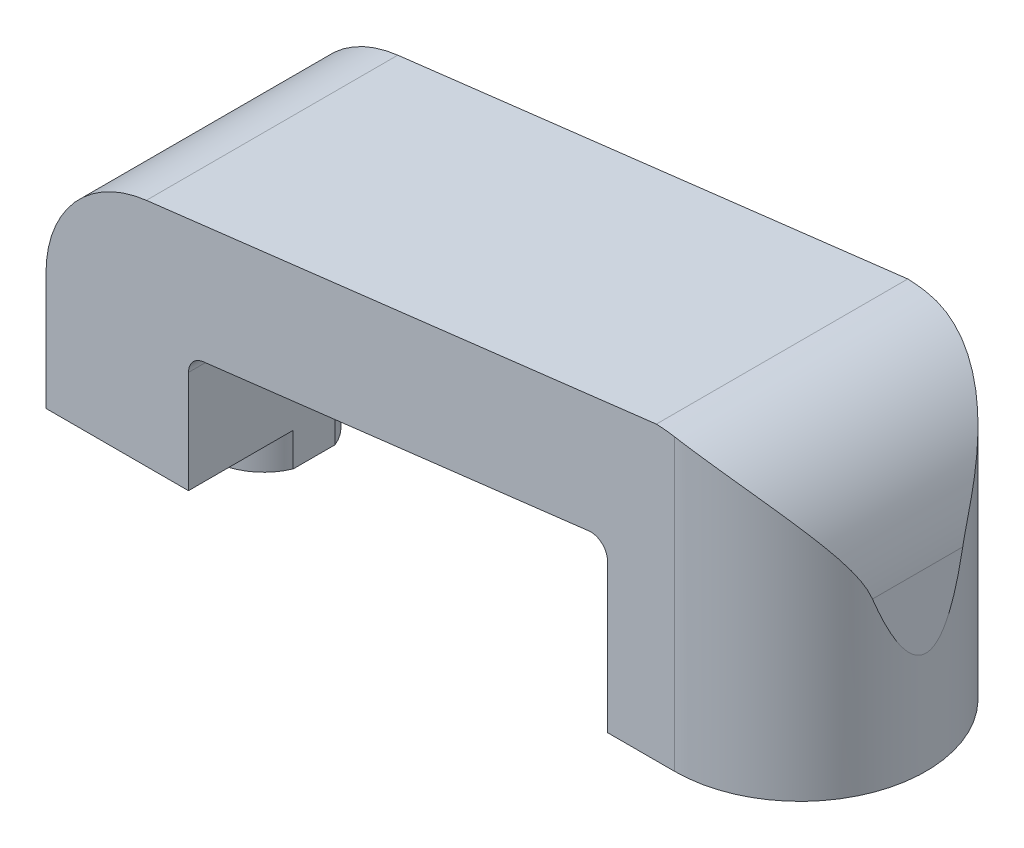
ISO-10303-21;
HEADER;
FILE_DESCRIPTION(('STEP AP214'),'2;1');
FILE_NAME('part.step','',(''),(''),'','','');
FILE_SCHEMA(('AUTOMOTIVE_DESIGN { 1 0 10303 214 1 1 1 1 }'));
ENDSEC;
DATA;
#1=APPLICATION_CONTEXT('core data for automotive mechanical design processes');
#2=APPLICATION_PROTOCOL_DEFINITION('international standard','automotive_design',2000,#1);
#3=PRODUCT_CONTEXT('',#1,'mechanical');
#4=PRODUCT('Part','Part','',(#3));
#5=PRODUCT_RELATED_PRODUCT_CATEGORY('part','',(#4));
#6=PRODUCT_DEFINITION_FORMATION('','',#4);
#7=PRODUCT_DEFINITION_CONTEXT('part definition',#1,'design');
#8=PRODUCT_DEFINITION('design','',#6,#7);
#9=PRODUCT_DEFINITION_SHAPE('','',#8);
#10=(LENGTH_UNIT() NAMED_UNIT(*) SI_UNIT(.MILLI.,.METRE.));
#11=(NAMED_UNIT(*) PLANE_ANGLE_UNIT() SI_UNIT($,.RADIAN.));
#12=(NAMED_UNIT(*) SI_UNIT($,.STERADIAN.) SOLID_ANGLE_UNIT());
#13=UNCERTAINTY_MEASURE_WITH_UNIT(LENGTH_MEASURE(1.E-05),#10,'distance_accuracy_value','');
#14=(GEOMETRIC_REPRESENTATION_CONTEXT(3) GLOBAL_UNCERTAINTY_ASSIGNED_CONTEXT((#13)) GLOBAL_UNIT_ASSIGNED_CONTEXT((#10,
#11,#12)) REPRESENTATION_CONTEXT('',''));
#15=CARTESIAN_POINT('',(0.,0.,0.));
#16=DIRECTION('',(0.,0.,1.));
#17=DIRECTION('',(1.,0.,0.));
#18=AXIS2_PLACEMENT_3D('',#15,#16,#17);
#19=CARTESIAN_POINT('',(0.,0.,15.));
#20=DIRECTION('',(0.,1.,0.));
#21=DIRECTION('',(0.,0.,1.));
#22=AXIS2_PLACEMENT_3D('',#19,#20,#21);
#23=PLANE('',#22);
#24=CARTESIAN_POINT('',(29.,0.,7.5));
#25=DIRECTION('',(0.,1.,0.));
#26=DIRECTION('',(0.,0.,1.));
#27=AXIS2_PLACEMENT_3D('',#24,#25,#26);
#28=CIRCLE('',#27,3.25);
#29=CARTESIAN_POINT('',(29.,0.,10.75));
#30=VERTEX_POINT('',#29);
#31=EDGE_CURVE('E12',#30,#30,#28,.F.);
#32=ORIENTED_EDGE('',*,*,#31,.F.);
#33=EDGE_LOOP('',(#32));
#34=FACE_BOUND('',#33,.T.);
#35=DIRECTION('',(1.,0.,0.));
#36=VECTOR('',#35,1.);
#37=CARTESIAN_POINT('',(0.,0.,0.));
#38=LINE('',#37,#36);
#39=CARTESIAN_POINT('',(25.,0.,0.));
#40=VERTEX_POINT('',#39);
#41=CARTESIAN_POINT('',(29.,0.,0.));
#42=VERTEX_POINT('',#41);
#43=EDGE_CURVE('E298',#40,#42,#38,.T.);
#44=ORIENTED_EDGE('',*,*,#43,.T.);
#45=CARTESIAN_POINT('',(29.,0.,7.5));
#46=DIRECTION('',(0.,-1.,0.));
#47=DIRECTION('',(0.,0.,-1.));
#48=AXIS2_PLACEMENT_3D('',#45,#46,#47);
#49=CIRCLE('',#48,7.5);
#50=CARTESIAN_POINT('',(29.,0.,15.));
#51=VERTEX_POINT('',#50);
#52=EDGE_CURVE('E191',#51,#42,#49,.F.);
#53=ORIENTED_EDGE('',*,*,#52,.F.);
#54=DIRECTION('',(1.,0.,0.));
#55=VECTOR('',#54,1.);
#56=CARTESIAN_POINT('',(0.,0.,15.));
#57=LINE('',#56,#55);
#58=CARTESIAN_POINT('',(25.,0.,15.));
#59=VERTEX_POINT('',#58);
#60=EDGE_CURVE('E305',#59,#51,#57,.T.);
#61=ORIENTED_EDGE('',*,*,#60,.F.);
#62=DIRECTION('',(0.,0.,-1.));
#63=VECTOR('',#62,1.);
#64=CARTESIAN_POINT('',(25.,0.,15.));
#65=LINE('',#64,#63);
#66=EDGE_CURVE('E302',#59,#40,#65,.T.);
#67=ORIENTED_EDGE('',*,*,#66,.T.);
#68=EDGE_LOOP('',(#44,#53,#61,#67));
#69=FACE_BOUND('',#68,.T.);
#70=ADVANCED_FACE('F58',(#34,#69),#23,.F.);
#71=CARTESIAN_POINT('',(0.,0.,15.));
#72=DIRECTION('',(0.,0.,1.));
#73=DIRECTION('',(1.,0.,0.));
#74=AXIS2_PLACEMENT_3D('',#71,#72,#73);
#75=PLANE('',#74);
#76=ORIENTED_EDGE('',*,*,#60,.T.);
#77=DIRECTION('',(0.,-1.,0.));
#78=VECTOR('',#77,1.);
#79=CARTESIAN_POINT('',(29.,25.,15.));
#80=LINE('',#79,#78);
#81=CARTESIAN_POINT('',(29.,17.28691057379,15.));
#82=VERTEX_POINT('',#81);
#83=EDGE_CURVE('E67',#51,#82,#80,.F.);
#84=ORIENTED_EDGE('',*,*,#83,.T.);
#85=CARTESIAN_POINT('',(27.579913930315,8.91708982116896,15.));
#86=DIRECTION('',(0.,0.,1.));
#87=DIRECTION('',(1.,0.,0.));
#88=AXIS2_PLACEMENT_3D('',#85,#86,#87);
#89=CIRCLE('',#88,8.48943719432087);
#90=CARTESIAN_POINT('',(27.9143195970498,17.3999382063739,15.));
#91=VERTEX_POINT('',#90);
#92=EDGE_CURVE('E301',#91,#82,#89,.F.);
#93=ORIENTED_EDGE('',*,*,#92,.F.);
#94=DIRECTION('',(0.992876838486922,0.119145220618431,0.));
#95=VECTOR('',#94,1.);
#96=CARTESIAN_POINT('',(-1.66209225410819,13.850768784235,15.));
#97=LINE('',#96,#95);
#98=CARTESIAN_POINT('',(-2.51273437525666,13.7486917296971,15.));
#99=VERTEX_POINT('',#98);
#100=EDGE_CURVE('E334',#99,#91,#97,.T.);
#101=ORIENTED_EDGE('',*,*,#100,.F.);
#102=CARTESIAN_POINT('',(-1.702891367693,7.,15.));
#103=DIRECTION('',(0.,0.,1.));
#104=DIRECTION('',(1.,0.,0.));
#105=AXIS2_PLACEMENT_3D('',#102,#103,#104);
#106=CIRCLE('',#105,6.797108632307);
#107=CARTESIAN_POINT('',(-8.5,7.,15.));
#108=VERTEX_POINT('',#107);
#109=EDGE_CURVE('E335',#99,#108,#106,.T.);
#110=ORIENTED_EDGE('',*,*,#109,.T.);
#111=DIRECTION('',(0.,1.,0.));
#112=VECTOR('',#111,1.);
#113=CARTESIAN_POINT('',(-8.5,0.,15.));
#114=LINE('',#113,#112);
#115=CARTESIAN_POINT('',(-8.5,0.,15.));
#116=VERTEX_POINT('',#115);
#117=EDGE_CURVE('E339',#116,#108,#114,.T.);
#118=ORIENTED_EDGE('',*,*,#117,.F.);
#119=DIRECTION('',(-1.,0.,0.));
#120=VECTOR('',#119,1.);
#121=CARTESIAN_POINT('',(0.,0.,15.));
#122=LINE('',#121,#120);
#123=CARTESIAN_POINT('',(0.,0.,15.));
#124=VERTEX_POINT('',#123);
#125=EDGE_CURVE('E342',#124,#116,#122,.T.);
#126=ORIENTED_EDGE('',*,*,#125,.F.);
#127=DIRECTION('',(0.,1.,0.));
#128=VECTOR('',#127,1.);
#129=CARTESIAN_POINT('',(0.,0.,15.));
#130=LINE('',#129,#128);
#131=CARTESIAN_POINT('',(0.,6.11282573503887,15.));
#132=VERTEX_POINT('',#131);
#133=EDGE_CURVE('E345',#124,#132,#130,.T.);
#134=ORIENTED_EDGE('',*,*,#133,.T.);
#135=CARTESIAN_POINT('',(1.,6.11282573503887,15.));
#136=DIRECTION('',(0.,0.,1.));
#137=DIRECTION('',(1.,0.,0.));
#138=AXIS2_PLACEMENT_3D('',#135,#136,#137);
#139=CIRCLE('',#138,0.999999999999999);
#140=CARTESIAN_POINT('',(0.88085477938157,7.10570257352579,15.));
#141=VERTEX_POINT('',#140);
#142=EDGE_CURVE('E347',#141,#132,#139,.T.);
#143=ORIENTED_EDGE('',*,*,#142,.F.);
#144=DIRECTION('',(0.992876838486922,0.119145220618431,0.));
#145=VECTOR('',#144,1.);
#146=CARTESIAN_POINT('',(-0.82807570977918,6.9006309148265,15.));
#147=LINE('',#146,#145);
#148=CARTESIAN_POINT('',(23.8808547793816,9.86570257352579,15.));
#149=VERTEX_POINT('',#148);
#150=EDGE_CURVE('E350',#141,#149,#147,.T.);
#151=ORIENTED_EDGE('',*,*,#150,.T.);
#152=CARTESIAN_POINT('',(24.,8.87282573503887,15.));
#153=DIRECTION('',(0.,0.,1.));
#154=DIRECTION('',(1.,0.,0.));
#155=AXIS2_PLACEMENT_3D('',#152,#153,#154);
#156=CIRCLE('',#155,1.);
#157=CARTESIAN_POINT('',(25.,8.87282573503887,15.));
#158=VERTEX_POINT('',#157);
#159=EDGE_CURVE('E352',#149,#158,#156,.F.);
#160=ORIENTED_EDGE('',*,*,#159,.T.);
#161=DIRECTION('',(0.,1.,0.));
#162=VECTOR('',#161,1.);
#163=CARTESIAN_POINT('',(25.,0.,15.));
#164=LINE('',#163,#162);
#165=EDGE_CURVE('E354',#59,#158,#164,.T.);
#166=ORIENTED_EDGE('',*,*,#165,.F.);
#167=EDGE_LOOP('',(#76,#84,#93,#101,#110,#118,#126,#134,#143,#151,#160,#166));
#168=FACE_BOUND('',#167,.T.);
#169=ADVANCED_FACE('F214',(#168),#75,.T.);
#170=CARTESIAN_POINT('',(0.,0.,0.));
#171=DIRECTION('',(0.,0.,1.));
#172=DIRECTION('',(1.,0.,0.));
#173=AXIS2_PLACEMENT_3D('',#170,#171,#172);
#174=PLANE('',#173);
#175=DIRECTION('',(0.,-1.,0.));
#176=VECTOR('',#175,1.);
#177=CARTESIAN_POINT('',(29.,25.,0.));
#178=LINE('',#177,#176);
#179=CARTESIAN_POINT('',(29.,17.28691057379,0.));
#180=VERTEX_POINT('',#179);
#181=EDGE_CURVE('E326',#42,#180,#178,.F.);
#182=ORIENTED_EDGE('',*,*,#181,.F.);
#183=ORIENTED_EDGE('',*,*,#43,.F.);
#184=DIRECTION('',(0.,1.,0.));
#185=VECTOR('',#184,1.);
#186=CARTESIAN_POINT('',(25.,0.,0.));
#187=LINE('',#186,#185);
#188=CARTESIAN_POINT('',(25.,8.87282573503887,0.));
#189=VERTEX_POINT('',#188);
#190=EDGE_CURVE('E295',#40,#189,#187,.T.);
#191=ORIENTED_EDGE('',*,*,#190,.T.);
#192=CARTESIAN_POINT('',(24.,8.87282573503887,0.));
#193=DIRECTION('',(0.,0.,1.));
#194=DIRECTION('',(1.,0.,0.));
#195=AXIS2_PLACEMENT_3D('',#192,#193,#194);
#196=CIRCLE('',#195,1.);
#197=CARTESIAN_POINT('',(23.8808547793816,9.86570257352579,0.));
#198=VERTEX_POINT('',#197);
#199=EDGE_CURVE('E292',#198,#189,#196,.F.);
#200=ORIENTED_EDGE('',*,*,#199,.F.);
#201=DIRECTION('',(0.992876838486922,0.119145220618431,0.));
#202=VECTOR('',#201,1.);
#203=CARTESIAN_POINT('',(-0.82807570977918,6.9006309148265,0.));
#204=LINE('',#203,#202);
#205=CARTESIAN_POINT('',(0.88085477938157,7.10570257352579,0.));
#206=VERTEX_POINT('',#205);
#207=EDGE_CURVE('E290',#206,#198,#204,.T.);
#208=ORIENTED_EDGE('',*,*,#207,.F.);
#209=CARTESIAN_POINT('',(1.,6.11282573503887,0.));
#210=DIRECTION('',(0.,0.,1.));
#211=DIRECTION('',(1.,0.,0.));
#212=AXIS2_PLACEMENT_3D('',#209,#210,#211);
#213=CIRCLE('',#212,0.999999999999999);
#214=CARTESIAN_POINT('',(0.,6.11282573503887,0.));
#215=VERTEX_POINT('',#214);
#216=EDGE_CURVE('E287',#206,#215,#213,.T.);
#217=ORIENTED_EDGE('',*,*,#216,.T.);
#218=DIRECTION('',(0.,1.,0.));
#219=VECTOR('',#218,1.);
#220=CARTESIAN_POINT('',(0.,0.,0.));
#221=LINE('',#220,#219);
#222=CARTESIAN_POINT('',(0.,0.,0.));
#223=VERTEX_POINT('',#222);
#224=EDGE_CURVE('E285',#223,#215,#221,.T.);
#225=ORIENTED_EDGE('',*,*,#224,.F.);
#226=DIRECTION('',(-1.,0.,0.));
#227=VECTOR('',#226,1.);
#228=CARTESIAN_POINT('',(0.,0.,0.));
#229=LINE('',#228,#227);
#230=CARTESIAN_POINT('',(-8.5,0.,0.));
#231=VERTEX_POINT('',#230);
#232=EDGE_CURVE('E282',#223,#231,#229,.T.);
#233=ORIENTED_EDGE('',*,*,#232,.T.);
#234=DIRECTION('',(0.,1.,0.));
#235=VECTOR('',#234,1.);
#236=CARTESIAN_POINT('',(-8.5,0.,0.));
#237=LINE('',#236,#235);
#238=CARTESIAN_POINT('',(-8.5,7.,0.));
#239=VERTEX_POINT('',#238);
#240=EDGE_CURVE('E275',#231,#239,#237,.T.);
#241=ORIENTED_EDGE('',*,*,#240,.T.);
#242=CARTESIAN_POINT('',(-1.702891367693,7.,0.));
#243=DIRECTION('',(0.,0.,1.));
#244=DIRECTION('',(1.,0.,0.));
#245=AXIS2_PLACEMENT_3D('',#242,#243,#244);
#246=CIRCLE('',#245,6.797108632307);
#247=CARTESIAN_POINT('',(-2.51273437525666,13.7486917296971,0.));
#248=VERTEX_POINT('',#247);
#249=EDGE_CURVE('E271',#248,#239,#246,.T.);
#250=ORIENTED_EDGE('',*,*,#249,.F.);
#251=DIRECTION('',(0.992876838486922,0.119145220618431,0.));
#252=VECTOR('',#251,1.);
#253=CARTESIAN_POINT('',(-1.66209225410819,13.850768784235,0.));
#254=LINE('',#253,#252);
#255=CARTESIAN_POINT('',(27.9143195970498,17.3999382063739,0.));
#256=VERTEX_POINT('',#255);
#257=EDGE_CURVE('E263',#248,#256,#254,.T.);
#258=ORIENTED_EDGE('',*,*,#257,.T.);
#259=CARTESIAN_POINT('',(27.579913930315,8.91708982116896,0.));
#260=DIRECTION('',(0.,0.,1.));
#261=DIRECTION('',(1.,0.,0.));
#262=AXIS2_PLACEMENT_3D('',#259,#260,#261);
#263=CIRCLE('',#262,8.48943719432087);
#264=EDGE_CURVE('E272',#256,#180,#263,.F.);
#265=ORIENTED_EDGE('',*,*,#264,.T.);
#266=EDGE_LOOP('',(#182,#183,#191,#200,#208,#217,#225,#233,#241,#250,#258,#265));
#267=FACE_BOUND('',#266,.T.);
#268=ADVANCED_FACE('F218',(#267),#174,.F.);
#269=CARTESIAN_POINT('',(27.579913930315,8.91708982116896,15.));
#270=DIRECTION('',(0.,0.,-1.));
#271=DIRECTION('',(-1.,0.,0.));
#272=AXIS2_PLACEMENT_3D('',#269,#270,#271);
#273=CYLINDRICAL_SURFACE('',#272,8.48943719432087);
#274=CARTESIAN_POINT('',(36.,10.,10.1925824035672));
#275=CARTESIAN_POINT('',(35.9850395142247,10.1162311993122,10.2315140835038));
#276=CARTESIAN_POINT('',(35.967911467498,10.2304791017013,10.275042644064));
#277=CARTESIAN_POINT('',(35.9296508197719,10.4550899612648,10.3692254842993));
#278=CARTESIAN_POINT('',(35.9085253489824,10.5654594270082,10.4198670356952));
#279=CARTESIAN_POINT('',(35.8626531564027,10.7822946933169,10.5261099639975));
#280=CARTESIAN_POINT('',(35.8379238655924,10.8887763613299,10.5816869901151));
#281=CARTESIAN_POINT('',(35.7849352870937,11.0988086521925,10.696665382489));
#282=CARTESIAN_POINT('',(35.756674228408,11.2023577723416,10.7560686601178));
#283=CARTESIAN_POINT('',(35.6667200220355,11.5093275846931,10.9384825578595));
#284=CARTESIAN_POINT('',(35.5999069350256,11.7088336046532,11.0655751440054));
#285=CARTESIAN_POINT('',(35.4529936750771,12.099658884898,11.3250801735385));
#286=CARTESIAN_POINT('',(35.3728731900789,12.2909650587718,11.4575005112582));
#287=CARTESIAN_POINT('',(35.1715412943912,12.7266056524414,11.7668688042689));
#288=CARTESIAN_POINT('',(35.0453984874005,12.9682289075412,11.9444533022621));
#289=CARTESIAN_POINT('',(34.7696341999211,13.4395816475757,12.297029401254));
#290=CARTESIAN_POINT('',(34.6200179036376,13.6693137438524,12.4720215654618));
#291=CARTESIAN_POINT('',(34.2966397580629,14.1163386218412,12.8151833754615));
#292=CARTESIAN_POINT('',(34.1228926260279,14.3336388724619,12.9833570996167));
#293=CARTESIAN_POINT('',(33.7504276340404,14.7543972907915,13.3090096622845));
#294=CARTESIAN_POINT('',(33.551721631936,14.9578619614327,13.4664935251311));
#295=CARTESIAN_POINT('',(33.2028016591876,15.2801624071011,13.7140870852316));
#296=CARTESIAN_POINT('',(33.0599438507377,15.4037022361912,13.8084921693204));
#297=CARTESIAN_POINT('',(32.7633681986451,15.6430577924473,13.9897807055734));
#298=CARTESIAN_POINT('',(32.6096515512208,15.7588743676889,14.0766649838963));
#299=CARTESIAN_POINT('',(32.2916075366309,15.9816596921507,14.2414663800761));
#300=CARTESIAN_POINT('',(32.1272903737295,16.0886367306888,14.3193919264958));
#301=CARTESIAN_POINT('',(31.7882472649749,16.2926980217125,14.4648895002759));
#302=CARTESIAN_POINT('',(31.6135233546528,16.3897841988194,14.5324635431859));
#303=CARTESIAN_POINT('',(31.284915164864,16.5572130774683,14.6452070791148));
#304=CARTESIAN_POINT('',(31.1325516139971,16.6292941047947,14.6922322409803));
#305=CARTESIAN_POINT('',(30.8216735491039,16.7650378763814,14.7771873522688));
#306=CARTESIAN_POINT('',(30.6631603500374,16.8287024076212,14.8151192337609));
#307=CARTESIAN_POINT('',(30.3410740631366,16.9467785513443,14.8809542450785));
#308=CARTESIAN_POINT('',(30.1775121448793,17.0012090703525,14.9088780001957));
#309=CARTESIAN_POINT('',(29.8460737283246,17.1003008242768,14.9539985803467));
#310=CARTESIAN_POINT('',(29.678199938626,17.1449680322528,14.9712019759423));
#311=CARTESIAN_POINT('',(29.4246259730499,17.2041315998661,14.9884456481504));
#312=CARTESIAN_POINT('',(29.3400868459262,17.2224991484257,14.9927663243045));
#313=CARTESIAN_POINT('',(29.1704432170662,17.2566488104019,14.9985431267836));
#314=CARTESIAN_POINT('',(29.0853390792843,17.2724324465123,15.0000009457943));
#315=CARTESIAN_POINT('',(29.,17.28691057379,15.));
#316=B_SPLINE_CURVE_WITH_KNOTS('',3,(#274,#275,#276,#277,#278,#279,#280,#281,#282,#283,#284,
#285,#286,#287,#288,#289,#290,#291,#292,#293,#294,#295,#296,#297,#298,#299,#300,#301,#302,#303,
#304,#305,#306,#307,#308,#309,#310,#311,#312,#313,#314,#315),.UNSPECIFIED.,.F.,.F.,(4,2,2,2,2,2,
2,2,2,2,2,2,2,2,2,2,2,2,2,2,4),(0.,0.370120067923215,0.739586071413386,1.1073209591996,
1.47524099239503,2.21189295756732,2.94967983986542,3.92451656946547,4.89913830511695,
5.87316821382156,6.84673710328154,7.4796978222137,8.11258892209757,8.74487962578811,
9.37704705873087,9.90151782280738,10.4258770524738,10.9491493547707,11.4721006246162,
11.7318820336163,11.9915097986082),.UNSPECIFIED.);
#317=CARTESIAN_POINT('',(36.,10.,10.1925824035672));
#318=VERTEX_POINT('',#317);
#319=EDGE_CURVE('E82',#318,#82,#316,.T.);
#320=ORIENTED_EDGE('',*,*,#319,.F.);
#321=DIRECTION('',(0.,0.,-1.));
#322=VECTOR('',#321,1.);
#323=CARTESIAN_POINT('',(36.,10.,15.));
#324=LINE('',#323,#322);
#325=CARTESIAN_POINT('',(36.,10.,4.80741759643277));
#326=VERTEX_POINT('',#325);
#327=EDGE_CURVE('E323',#318,#326,#324,.T.);
#328=ORIENTED_EDGE('',*,*,#327,.T.);
#329=CARTESIAN_POINT('',(29.,17.28691057379,0.));
#330=CARTESIAN_POINT('',(29.0922506244348,17.2712602400903,-1.33220275772499E-06));
#331=CARTESIAN_POINT('',(29.1842254332684,17.2540840113151,0.00170244948249326));
#332=CARTESIAN_POINT('',(29.3674298874018,17.2167323700816,0.00844510268472733));
#333=CARTESIAN_POINT('',(29.4586596205363,17.1965573166907,0.0134835751678411));
#334=CARTESIAN_POINT('',(29.7307243720973,17.1316661811325,0.0334706336332341));
#335=CARTESIAN_POINT('',(29.9101896262557,17.0825407970242,0.0532912813515599));
#336=CARTESIAN_POINT('',(30.2622725507422,16.9737125407059,0.104862128581056));
#337=CARTESIAN_POINT('',(30.4349371824814,16.9141084334154,0.136503797938997));
#338=CARTESIAN_POINT('',(30.7740467047331,16.7848084230826,0.210768728385241));
#339=CARTESIAN_POINT('',(30.9404900153039,16.7151099781369,0.253394757610725));
#340=CARTESIAN_POINT('',(31.2654948783266,16.566847731493,0.348352166342965));
#341=CARTESIAN_POINT('',(31.424089354561,16.4883264694214,0.400637697469449));
#342=CARTESIAN_POINT('',(31.7336741665026,16.3230091343506,0.513998428230352));
#343=CARTESIAN_POINT('',(31.8846617476446,16.2362100963004,0.575076781424041));
#344=CARTESIAN_POINT('',(32.325997811216,15.9644064613832,0.770120238106193));
#345=CARTESIAN_POINT('',(32.6043397853279,15.7681715340884,0.915778572445883));
#346=CARTESIAN_POINT('',(33.2593259925139,15.2469991482076,1.3097792521858));
#347=CARTESIAN_POINT('',(33.6150528166499,14.906951000196,1.57293315424202));
#348=CARTESIAN_POINT('',(34.0938992522898,14.3665768797683,1.99114295979503));
#349=CARTESIAN_POINT('',(34.2447231356118,14.1808592924603,2.13487934178741));
#350=CARTESIAN_POINT('',(34.5284449736017,13.8001988262293,2.4277431648175));
#351=CARTESIAN_POINT('',(34.6613479854343,13.6052585709535,2.57686906983752));
#352=CARTESIAN_POINT('',(34.9137743823442,13.2000705545737,2.88286976145957));
#353=CARTESIAN_POINT('',(35.0327113932534,12.9895299230342,3.03983785216139));
#354=CARTESIAN_POINT('',(35.2524531127341,12.5586867262038,3.3534942060738));
#355=CARTESIAN_POINT('',(35.3532425989131,12.3383761570087,3.51018212621609));
#356=CARTESIAN_POINT('',(35.5359673460634,11.8886680336693,3.81725169854164));
#357=CARTESIAN_POINT('',(35.6180513378188,11.6593604741661,3.96767472225904));
#358=CARTESIAN_POINT('',(35.7273899065428,11.3054643606914,4.18355875145799));
#359=CARTESIAN_POINT('',(35.7615189331067,11.1859311636554,4.25384877435468));
#360=CARTESIAN_POINT('',(35.8250422853349,10.9429669441332,4.38963061315345));
#361=CARTESIAN_POINT('',(35.8544382449311,10.8195372844452,4.45512408063005));
#362=CARTESIAN_POINT('',(35.905240536311,10.5821806005544,4.57233034557346));
#363=CARTESIAN_POINT('',(35.9271723379156,10.4687296010335,4.62476540788476));
#364=CARTESIAN_POINT('',(35.9668457856997,10.2375662507936,4.72224769458987));
#365=CARTESIAN_POINT('',(35.9845735508112,10.1198412234709,4.76727029863842));
#366=CARTESIAN_POINT('',(36.,10.,4.80741759643277));
#367=B_SPLINE_CURVE_WITH_KNOTS('',3,(#329,#330,#331,#332,#333,#334,#335,#336,#337,#338,#339,
#340,#341,#342,#343,#344,#345,#346,#347,#348,#349,#350,#351,#352,#353,#354,#355,#356,#357,#358,
#359,#360,#361,#362,#363,#364,#365,#366),.UNSPECIFIED.,.F.,.F.,(4,2,2,2,2,2,2,2,2,2,2,2,2,2,2,2,
2,2,4),(0.,0.280646177749347,0.561258779045994,1.12171222253807,1.67714171589712,
2.23271131857602,2.78570869788222,3.33890490696858,4.44658667043742,6.11106898960647,
6.94783916187558,7.78437270612637,8.64851620411529,9.51338121451034,10.3711089046184,
10.7993679079773,11.2274787508751,11.6078300613727,11.9894202707387),.UNSPECIFIED.);
#368=EDGE_CURVE('E193',#180,#326,#367,.T.);
#369=ORIENTED_EDGE('',*,*,#368,.F.);
#370=ORIENTED_EDGE('',*,*,#264,.F.);
#371=DIRECTION('',(0.,0.,-1.));
#372=VECTOR('',#371,1.);
#373=CARTESIAN_POINT('',(27.9143195970498,17.3999382063739,15.));
#374=LINE('',#373,#372);
#375=EDGE_CURVE('E267',#91,#256,#374,.T.);
#376=ORIENTED_EDGE('',*,*,#375,.F.);
#377=ORIENTED_EDGE('',*,*,#92,.T.);
#378=EDGE_LOOP('',(#320,#328,#369,#370,#376,#377));
#379=FACE_BOUND('',#378,.T.);
#380=ADVANCED_FACE('F60',(#379),#273,.T.);
#381=CARTESIAN_POINT('',(-1.66209225410819,13.850768784235,15.));
#382=DIRECTION('',(-0.119145220618431,0.992876838486922,0.));
#383=DIRECTION('',(-0.992876838486922,-0.119145220618431,0.));
#384=AXIS2_PLACEMENT_3D('',#381,#382,#383);
#385=PLANE('',#384);
#386=ORIENTED_EDGE('',*,*,#257,.F.);
#387=DIRECTION('',(0.,0.,-1.));
#388=VECTOR('',#387,1.);
#389=CARTESIAN_POINT('',(-2.51273437525666,13.7486917296971,15.));
#390=LINE('',#389,#388);
#391=EDGE_CURVE('E265',#99,#248,#390,.T.);
#392=ORIENTED_EDGE('',*,*,#391,.F.);
#393=ORIENTED_EDGE('',*,*,#100,.T.);
#394=ORIENTED_EDGE('',*,*,#375,.T.);
#395=EDGE_LOOP('',(#386,#392,#393,#394));
#396=FACE_BOUND('',#395,.T.);
#397=ADVANCED_FACE('F253',(#396),#385,.T.);
#398=CARTESIAN_POINT('',(-1.702891367693,7.,15.));
#399=DIRECTION('',(0.,0.,-1.));
#400=DIRECTION('',(-1.,0.,0.));
#401=AXIS2_PLACEMENT_3D('',#398,#399,#400);
#402=CYLINDRICAL_SURFACE('',#401,6.797108632307);
#403=ORIENTED_EDGE('',*,*,#249,.T.);
#404=DIRECTION('',(0.,0.,-1.));
#405=VECTOR('',#404,1.);
#406=CARTESIAN_POINT('',(-8.5,7.,15.));
#407=LINE('',#406,#405);
#408=EDGE_CURVE('E319',#108,#239,#407,.T.);
#409=ORIENTED_EDGE('',*,*,#408,.F.);
#410=ORIENTED_EDGE('',*,*,#109,.F.);
#411=ORIENTED_EDGE('',*,*,#391,.T.);
#412=EDGE_LOOP('',(#403,#409,#410,#411));
#413=FACE_BOUND('',#412,.T.);
#414=ADVANCED_FACE('F250',(#413),#402,.T.);
#415=CARTESIAN_POINT('',(-8.5,0.,15.));
#416=DIRECTION('',(-1.,0.,0.));
#417=DIRECTION('',(0.,0.,1.));
#418=AXIS2_PLACEMENT_3D('',#415,#416,#417);
#419=PLANE('',#418);
#420=ORIENTED_EDGE('',*,*,#240,.F.);
#421=DIRECTION('',(0.,0.,-1.));
#422=VECTOR('',#421,1.);
#423=CARTESIAN_POINT('',(-8.5,0.,15.));
#424=LINE('',#423,#422);
#425=EDGE_CURVE('E317',#116,#231,#424,.T.);
#426=ORIENTED_EDGE('',*,*,#425,.F.);
#427=ORIENTED_EDGE('',*,*,#117,.T.);
#428=ORIENTED_EDGE('',*,*,#408,.T.);
#429=EDGE_LOOP('',(#420,#426,#427,#428));
#430=FACE_BOUND('',#429,.T.);
#431=ADVANCED_FACE('F246',(#430),#419,.T.);
#432=CARTESIAN_POINT('',(0.,0.,15.));
#433=DIRECTION('',(0.,-1.,0.));
#434=DIRECTION('',(1.,0.,0.));
#435=AXIS2_PLACEMENT_3D('',#432,#433,#434);
#436=PLANE('',#435);
#437=DIRECTION('',(0.,0.,-1.));
#438=VECTOR('',#437,1.);
#439=CARTESIAN_POINT('',(0.,0.,15.));
#440=LINE('',#439,#438);
#441=CARTESIAN_POINT('',(0.,0.,6.25000000000002));
#442=VERTEX_POINT('',#441);
#443=EDGE_CURVE('E314',#442,#223,#440,.T.);
#444=ORIENTED_EDGE('',*,*,#443,.F.);
#445=CARTESIAN_POINT('',(-3.00000000000001,0.,7.5));
#446=DIRECTION('',(0.,-1.,0.));
#447=DIRECTION('',(0.,0.,-1.));
#448=AXIS2_PLACEMENT_3D('',#445,#446,#447);
#449=CIRCLE('',#448,3.25);
#450=CARTESIAN_POINT('',(0.,0.,8.74999999999997));
#451=VERTEX_POINT('',#450);
#452=EDGE_CURVE('E74',#451,#442,#449,.T.);
#453=ORIENTED_EDGE('',*,*,#452,.F.);
#454=EDGE_CURVE('E315',#124,#451,#440,.T.);
#455=ORIENTED_EDGE('',*,*,#454,.F.);
#456=ORIENTED_EDGE('',*,*,#125,.T.);
#457=ORIENTED_EDGE('',*,*,#425,.T.);
#458=ORIENTED_EDGE('',*,*,#232,.F.);
#459=EDGE_LOOP('',(#444,#453,#455,#456,#457,#458));
#460=FACE_BOUND('',#459,.T.);
#461=ADVANCED_FACE('F243',(#460),#436,.T.);
#462=CARTESIAN_POINT('',(0.,0.,15.));
#463=DIRECTION('',(-1.,0.,0.));
#464=DIRECTION('',(0.,0.,1.));
#465=AXIS2_PLACEMENT_3D('',#462,#463,#464);
#466=PLANE('',#465);
#467=ORIENTED_EDGE('',*,*,#224,.T.);
#468=DIRECTION('',(0.,0.,-1.));
#469=VECTOR('',#468,1.);
#470=CARTESIAN_POINT('',(0.,6.11282573503887,15.));
#471=LINE('',#470,#469);
#472=EDGE_CURVE('E312',#132,#215,#471,.T.);
#473=ORIENTED_EDGE('',*,*,#472,.F.);
#474=ORIENTED_EDGE('',*,*,#133,.F.);
#475=ORIENTED_EDGE('',*,*,#454,.T.);
#476=DIRECTION('',(0.,1.,0.));
#477=VECTOR('',#476,1.);
#478=CARTESIAN_POINT('',(0.,-2.,8.74999999999997));
#479=LINE('',#478,#477);
#480=CARTESIAN_POINT('',(0.,-2.,8.74999999999997));
#481=VERTEX_POINT('',#480);
#482=EDGE_CURVE('E177',#481,#451,#479,.T.);
#483=ORIENTED_EDGE('',*,*,#482,.F.);
#484=DIRECTION('',(0.,0.,-1.));
#485=VECTOR('',#484,1.);
#486=CARTESIAN_POINT('',(0.,-2.,8.74999999999997));
#487=LINE('',#486,#485);
#488=CARTESIAN_POINT('',(0.,-2.,6.25000000000002));
#489=VERTEX_POINT('',#488);
#490=EDGE_CURVE('E171',#481,#489,#487,.T.);
#491=ORIENTED_EDGE('',*,*,#490,.T.);
#492=DIRECTION('',(0.,1.,0.));
#493=VECTOR('',#492,1.);
#494=CARTESIAN_POINT('',(0.,-2.,6.25000000000002));
#495=LINE('',#494,#493);
#496=EDGE_CURVE('E172',#489,#442,#495,.T.);
#497=ORIENTED_EDGE('',*,*,#496,.T.);
#498=ORIENTED_EDGE('',*,*,#443,.T.);
#499=EDGE_LOOP('',(#467,#473,#474,#475,#483,#491,#497,#498));
#500=FACE_BOUND('',#499,.T.);
#501=ADVANCED_FACE('F180',(#500),#466,.F.);
#502=CARTESIAN_POINT('',(1.,6.11282573503887,15.));
#503=DIRECTION('',(0.,0.,-1.));
#504=DIRECTION('',(-1.,0.,0.));
#505=AXIS2_PLACEMENT_3D('',#502,#503,#504);
#506=CYLINDRICAL_SURFACE('',#505,0.999999999999999);
#507=ORIENTED_EDGE('',*,*,#216,.F.);
#508=DIRECTION('',(0.,0.,-1.));
#509=VECTOR('',#508,1.);
#510=CARTESIAN_POINT('',(0.88085477938157,7.10570257352579,15.));
#511=LINE('',#510,#509);
#512=EDGE_CURVE('E310',#141,#206,#511,.T.);
#513=ORIENTED_EDGE('',*,*,#512,.F.);
#514=ORIENTED_EDGE('',*,*,#142,.T.);
#515=ORIENTED_EDGE('',*,*,#472,.T.);
#516=EDGE_LOOP('',(#507,#513,#514,#515));
#517=FACE_BOUND('',#516,.T.);
#518=ADVANCED_FACE('F236',(#517),#506,.F.);
#519=CARTESIAN_POINT('',(-0.82807570977918,6.9006309148265,15.));
#520=DIRECTION('',(-0.119145220618431,0.992876838486922,0.));
#521=DIRECTION('',(-0.992876838486922,-0.119145220618431,0.));
#522=AXIS2_PLACEMENT_3D('',#519,#520,#521);
#523=PLANE('',#522);
#524=ORIENTED_EDGE('',*,*,#207,.T.);
#525=DIRECTION('',(0.,0.,-1.));
#526=VECTOR('',#525,1.);
#527=CARTESIAN_POINT('',(23.8808547793816,9.86570257352579,15.));
#528=LINE('',#527,#526);
#529=EDGE_CURVE('E307',#149,#198,#528,.T.);
#530=ORIENTED_EDGE('',*,*,#529,.F.);
#531=ORIENTED_EDGE('',*,*,#150,.F.);
#532=ORIENTED_EDGE('',*,*,#512,.T.);
#533=EDGE_LOOP('',(#524,#530,#531,#532));
#534=FACE_BOUND('',#533,.T.);
#535=ADVANCED_FACE('F232',(#534),#523,.F.);
#536=CARTESIAN_POINT('',(24.,8.87282573503887,15.));
#537=DIRECTION('',(0.,0.,-1.));
#538=DIRECTION('',(-1.,0.,0.));
#539=AXIS2_PLACEMENT_3D('',#536,#537,#538);
#540=CYLINDRICAL_SURFACE('',#539,1.);
#541=ORIENTED_EDGE('',*,*,#199,.T.);
#542=DIRECTION('',(0.,0.,-1.));
#543=VECTOR('',#542,1.);
#544=CARTESIAN_POINT('',(25.,8.87282573503887,15.));
#545=LINE('',#544,#543);
#546=EDGE_CURVE('E304',#158,#189,#545,.T.);
#547=ORIENTED_EDGE('',*,*,#546,.F.);
#548=ORIENTED_EDGE('',*,*,#159,.F.);
#549=ORIENTED_EDGE('',*,*,#529,.T.);
#550=EDGE_LOOP('',(#541,#547,#548,#549));
#551=FACE_BOUND('',#550,.T.);
#552=ADVANCED_FACE('F228',(#551),#540,.F.);
#553=CARTESIAN_POINT('',(25.,0.,15.));
#554=DIRECTION('',(-1.,0.,0.));
#555=DIRECTION('',(0.,-1.,0.));
#556=AXIS2_PLACEMENT_3D('',#553,#554,#555);
#557=PLANE('',#556);
#558=ORIENTED_EDGE('',*,*,#190,.F.);
#559=ORIENTED_EDGE('',*,*,#66,.F.);
#560=ORIENTED_EDGE('',*,*,#165,.T.);
#561=ORIENTED_EDGE('',*,*,#546,.T.);
#562=EDGE_LOOP('',(#558,#559,#560,#561));
#563=FACE_BOUND('',#562,.T.);
#564=ADVANCED_FACE('F212',(#563),#557,.T.);
#565=CARTESIAN_POINT('',(29.,25.,7.5));
#566=DIRECTION('',(0.,-1.,0.));
#567=DIRECTION('',(0.,0.,-1.));
#568=AXIS2_PLACEMENT_3D('',#565,#566,#567);
#569=CYLINDRICAL_SURFACE('',#568,7.5);
#570=CARTESIAN_POINT('',(29.,64.4279697799302,7.5));
#571=DIRECTION('',(-0.991830892549355,-0.127559713800047,0.));
#572=DIRECTION('',(0.127559713800047,-0.991830892549355,0.));
#573=AXIS2_PLACEMENT_3D('',#570,#571,#572);
#574=ELLIPSE('',#573,58.7959926890118,7.5);
#575=EDGE_CURVE('E188',#326,#318,#574,.T.);
#576=ORIENTED_EDGE('',*,*,#575,.T.);
#577=ORIENTED_EDGE('',*,*,#319,.T.);
#578=ORIENTED_EDGE('',*,*,#83,.F.);
#579=ORIENTED_EDGE('',*,*,#52,.T.);
#580=ORIENTED_EDGE('',*,*,#181,.T.);
#581=ORIENTED_EDGE('',*,*,#368,.T.);
#582=EDGE_LOOP('',(#576,#577,#578,#579,#580,#581));
#583=FACE_BOUND('',#582,.T.);
#584=ADVANCED_FACE('F206',(#583),#569,.T.);
#585=CARTESIAN_POINT('',(36.6794033468654,4.71735073834657,0.));
#586=DIRECTION('',(-0.991830892549355,-0.127559713800047,0.));
#587=DIRECTION('',(0.127559713800047,-0.991830892549355,0.));
#588=AXIS2_PLACEMENT_3D('',#585,#586,#587);
#589=PLANE('',#588);
#590=ORIENTED_EDGE('',*,*,#575,.F.);
#591=ORIENTED_EDGE('',*,*,#327,.F.);
#592=EDGE_LOOP('',(#590,#591));
#593=FACE_BOUND('',#592,.T.);
#594=ADVANCED_FACE('F211',(#593),#589,.F.);
#595=CARTESIAN_POINT('',(-3.00000000000001,-2.,7.5));
#596=DIRECTION('',(0.,-1.,0.));
#597=DIRECTION('',(0.,0.,-1.));
#598=AXIS2_PLACEMENT_3D('',#595,#596,#597);
#599=PLANE('',#598);
#600=ORIENTED_EDGE('',*,*,#490,.F.);
#601=CARTESIAN_POINT('',(-3.00000000000001,-2.,7.5));
#602=DIRECTION('',(0.,-1.,0.));
#603=DIRECTION('',(0.,0.,-1.));
#604=AXIS2_PLACEMENT_3D('',#601,#602,#603);
#605=CIRCLE('',#604,3.25);
#606=EDGE_CURVE('E167',#481,#489,#605,.T.);
#607=ORIENTED_EDGE('',*,*,#606,.T.);
#608=EDGE_LOOP('',(#600,#607));
#609=FACE_BOUND('',#608,.T.);
#610=CARTESIAN_POINT('',(-3.00000000000001,-2.,7.5));
#611=DIRECTION('',(0.,-1.,0.));
#612=DIRECTION('',(0.,0.,-1.));
#613=AXIS2_PLACEMENT_3D('',#610,#611,#612);
#614=CIRCLE('',#613,1.25);
#615=CARTESIAN_POINT('',(-3.00000000000001,-2.,6.25));
#616=VERTEX_POINT('',#615);
#617=EDGE_CURVE('E183',#616,#616,#614,.T.);
#618=ORIENTED_EDGE('',*,*,#617,.F.);
#619=EDGE_LOOP('',(#618));
#620=FACE_BOUND('',#619,.T.);
#621=ADVANCED_FACE('F168',(#609,#620),#599,.T.);
#622=CARTESIAN_POINT('',(-3.00000000000001,-2.,7.5));
#623=DIRECTION('',(0.,1.,0.));
#624=DIRECTION('',(0.,0.,1.));
#625=AXIS2_PLACEMENT_3D('',#622,#623,#624);
#626=CYLINDRICAL_SURFACE('',#625,3.25);
#627=ORIENTED_EDGE('',*,*,#452,.T.);
#628=ORIENTED_EDGE('',*,*,#496,.F.);
#629=ORIENTED_EDGE('',*,*,#606,.F.);
#630=ORIENTED_EDGE('',*,*,#482,.T.);
#631=EDGE_LOOP('',(#627,#628,#629,#630));
#632=FACE_BOUND('',#631,.T.);
#633=ADVANCED_FACE('F174',(#632),#626,.T.);
#634=CARTESIAN_POINT('',(-3.00000000000001,-2.,7.5));
#635=DIRECTION('',(0.,1.,0.));
#636=DIRECTION('',(0.,0.,1.));
#637=AXIS2_PLACEMENT_3D('',#634,#635,#636);
#638=CYLINDRICAL_SURFACE('',#637,1.25);
#639=ORIENTED_EDGE('',*,*,#617,.T.);
#640=EDGE_LOOP('',(#639));
#641=FACE_BOUND('',#640,.T.);
#642=CARTESIAN_POINT('',(-3.00000000000001,8.,7.5));
#643=DIRECTION('',(0.,-1.,0.));
#644=DIRECTION('',(0.,0.,-1.));
#645=AXIS2_PLACEMENT_3D('',#642,#643,#644);
#646=CIRCLE('',#645,1.25);
#647=CARTESIAN_POINT('',(-3.00000000000001,8.,6.25));
#648=VERTEX_POINT('',#647);
#649=EDGE_CURVE('E408',#648,#648,#646,.F.);
#650=ORIENTED_EDGE('',*,*,#649,.T.);
#651=EDGE_LOOP('',(#650));
#652=FACE_BOUND('',#651,.T.);
#653=ADVANCED_FACE('F378',(#641,#652),#638,.F.);
#654=CARTESIAN_POINT('',(29.,-2.,7.5));
#655=DIRECTION('',(0.,-1.,0.));
#656=DIRECTION('',(0.,0.,-1.));
#657=AXIS2_PLACEMENT_3D('',#654,#655,#656);
#658=PLANE('',#657);
#659=CARTESIAN_POINT('',(29.,-2.,7.5));
#660=DIRECTION('',(0.,-1.,0.));
#661=DIRECTION('',(0.,0.,-1.));
#662=AXIS2_PLACEMENT_3D('',#659,#660,#661);
#663=CIRCLE('',#662,3.25);
#664=CARTESIAN_POINT('',(29.,-2.,4.25));
#665=VERTEX_POINT('',#664);
#666=EDGE_CURVE('E411',#665,#665,#663,.T.);
#667=ORIENTED_EDGE('',*,*,#666,.T.);
#668=EDGE_LOOP('',(#667));
#669=FACE_BOUND('',#668,.T.);
#670=CARTESIAN_POINT('',(29.,-2.,7.5));
#671=DIRECTION('',(0.,-1.,0.));
#672=DIRECTION('',(0.,0.,-1.));
#673=AXIS2_PLACEMENT_3D('',#670,#671,#672);
#674=CIRCLE('',#673,1.25);
#675=CARTESIAN_POINT('',(29.,-2.,6.25));
#676=VERTEX_POINT('',#675);
#677=EDGE_CURVE('E415',#676,#676,#674,.T.);
#678=ORIENTED_EDGE('',*,*,#677,.F.);
#679=EDGE_LOOP('',(#678));
#680=FACE_BOUND('',#679,.T.);
#681=ADVANCED_FACE('F382',(#669,#680),#658,.T.);
#682=CARTESIAN_POINT('',(29.,-2.,7.5));
#683=DIRECTION('',(0.,1.,0.));
#684=DIRECTION('',(0.,0.,1.));
#685=AXIS2_PLACEMENT_3D('',#682,#683,#684);
#686=CYLINDRICAL_SURFACE('',#685,3.25);
#687=ORIENTED_EDGE('',*,*,#666,.F.);
#688=EDGE_LOOP('',(#687));
#689=FACE_BOUND('',#688,.T.);
#690=ORIENTED_EDGE('',*,*,#31,.T.);
#691=EDGE_LOOP('',(#690));
#692=FACE_BOUND('',#691,.T.);
#693=ADVANCED_FACE('F388',(#689,#692),#686,.T.);
#694=CARTESIAN_POINT('',(29.,-2.,7.5));
#695=DIRECTION('',(0.,1.,0.));
#696=DIRECTION('',(0.,0.,1.));
#697=AXIS2_PLACEMENT_3D('',#694,#695,#696);
#698=CYLINDRICAL_SURFACE('',#697,1.25);
#699=ORIENTED_EDGE('',*,*,#677,.T.);
#700=EDGE_LOOP('',(#699));
#701=FACE_BOUND('',#700,.T.);
#702=CARTESIAN_POINT('',(29.,9.5,7.5));
#703=DIRECTION('',(0.,-1.,0.));
#704=DIRECTION('',(0.,0.,-1.));
#705=AXIS2_PLACEMENT_3D('',#702,#703,#704);
#706=CIRCLE('',#705,1.25);
#707=CARTESIAN_POINT('',(29.,9.5,6.25));
#708=VERTEX_POINT('',#707);
#709=EDGE_CURVE('E406',#708,#708,#706,.T.);
#710=ORIENTED_EDGE('',*,*,#709,.F.);
#711=EDGE_LOOP('',(#710));
#712=FACE_BOUND('',#711,.T.);
#713=ADVANCED_FACE('F384',(#701,#712),#698,.F.);
#714=CARTESIAN_POINT('',(0.,8.,0.));
#715=DIRECTION('',(0.,-1.,0.));
#716=DIRECTION('',(0.,0.,-1.));
#717=AXIS2_PLACEMENT_3D('',#714,#715,#716);
#718=PLANE('',#717);
#719=ORIENTED_EDGE('',*,*,#649,.F.);
#720=EDGE_LOOP('',(#719));
#721=FACE_BOUND('',#720,.T.);
#722=ADVANCED_FACE('F387',(#721),#718,.T.);
#723=CARTESIAN_POINT('',(29.,9.5,7.5));
#724=DIRECTION('',(0.,-1.,0.));
#725=DIRECTION('',(0.,0.,-1.));
#726=AXIS2_PLACEMENT_3D('',#723,#724,#725);
#727=PLANE('',#726);
#728=ORIENTED_EDGE('',*,*,#709,.T.);
#729=EDGE_LOOP('',(#728));
#730=FACE_BOUND('',#729,.T.);
#731=ADVANCED_FACE('F398',(#730),#727,.T.);
#732=CLOSED_SHELL('',(#70,#169,#268,#380,#397,#414,#431,#461,#501,#518,#535,#552,#564,#584,#594,
#621,#633,#653,#681,#693,#713,#722,#731));
#733=MANIFOLD_SOLID_BREP('B2',#732);
#734=ADVANCED_BREP_SHAPE_REPRESENTATION('',(#18,#733),#14);
#735=SHAPE_DEFINITION_REPRESENTATION(#9,#734);
ENDSEC;
END-ISO-10303-21;
